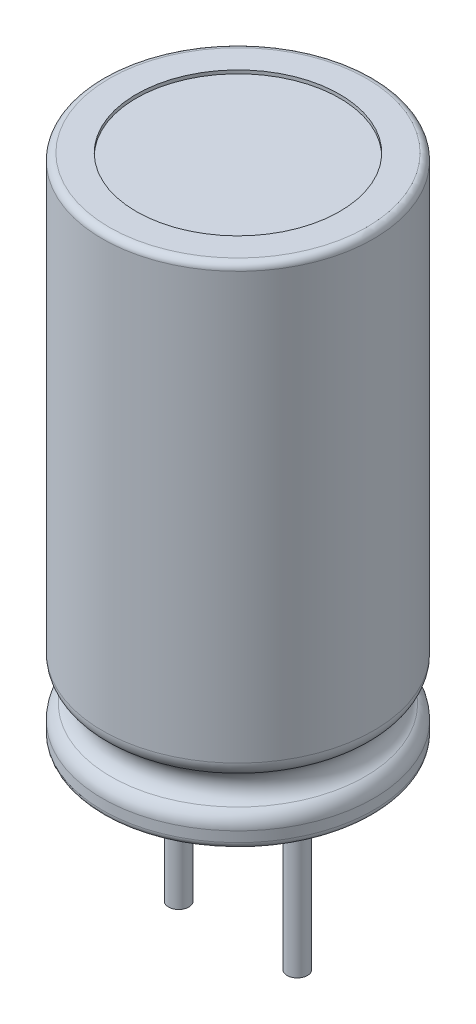
ISO-10303-21;
HEADER;
FILE_DESCRIPTION(('STEP AP214'),'2;1');
FILE_NAME('part.step','',(''),(''),'','','');
FILE_SCHEMA(('AUTOMOTIVE_DESIGN { 1 0 10303 214 1 1 1 1 }'));
ENDSEC;
DATA;
#1=APPLICATION_CONTEXT('core data for automotive mechanical design processes');
#2=APPLICATION_PROTOCOL_DEFINITION('international standard','automotive_design',2000,#1);
#3=PRODUCT_CONTEXT('',#1,'mechanical');
#4=PRODUCT('Part','Part','',(#3));
#5=PRODUCT_RELATED_PRODUCT_CATEGORY('part','',(#4));
#6=PRODUCT_DEFINITION_FORMATION('','',#4);
#7=PRODUCT_DEFINITION_CONTEXT('part definition',#1,'design');
#8=PRODUCT_DEFINITION('design','',#6,#7);
#9=PRODUCT_DEFINITION_SHAPE('','',#8);
#10=(LENGTH_UNIT() NAMED_UNIT(*) SI_UNIT(.MILLI.,.METRE.));
#11=(NAMED_UNIT(*) PLANE_ANGLE_UNIT() SI_UNIT($,.RADIAN.));
#12=(NAMED_UNIT(*) SI_UNIT($,.STERADIAN.) SOLID_ANGLE_UNIT());
#13=UNCERTAINTY_MEASURE_WITH_UNIT(LENGTH_MEASURE(1.E-05),#10,'distance_accuracy_value','');
#14=(GEOMETRIC_REPRESENTATION_CONTEXT(3) GLOBAL_UNCERTAINTY_ASSIGNED_CONTEXT((#13)) GLOBAL_UNIT_ASSIGNED_CONTEXT((#10,
#11,#12)) REPRESENTATION_CONTEXT('',''));
#15=CARTESIAN_POINT('',(0.,0.,0.));
#16=DIRECTION('',(0.,0.,1.));
#17=DIRECTION('',(1.,0.,0.));
#18=AXIS2_PLACEMENT_3D('',#15,#16,#17);
#19=CARTESIAN_POINT('',(1.75,-5.,0.));
#20=DIRECTION('',(0.,1.,0.));
#21=DIRECTION('',(0.,0.,1.));
#22=AXIS2_PLACEMENT_3D('',#19,#20,#21);
#23=CYLINDRICAL_SURFACE('',#22,0.3);
#24=CARTESIAN_POINT('',(1.75,-5.,0.));
#25=DIRECTION('',(0.,-1.,0.));
#26=DIRECTION('',(0.,0.,-1.));
#27=AXIS2_PLACEMENT_3D('',#24,#25,#26);
#28=CIRCLE('',#27,0.3);
#29=CARTESIAN_POINT('',(1.75,-5.,-0.3));
#30=VERTEX_POINT('',#29);
#31=EDGE_CURVE('E11',#30,#30,#28,.T.);
#32=ORIENTED_EDGE('',*,*,#31,.F.);
#33=EDGE_LOOP('',(#32));
#34=FACE_BOUND('',#33,.T.);
#35=CARTESIAN_POINT('',(1.75,5.,0.));
#36=DIRECTION('',(0.,-1.,0.));
#37=DIRECTION('',(0.,0.,-1.));
#38=AXIS2_PLACEMENT_3D('',#35,#36,#37);
#39=CIRCLE('',#38,0.3);
#40=CARTESIAN_POINT('',(1.75,5.,-0.3));
#41=VERTEX_POINT('',#40);
#42=EDGE_CURVE('E43',#41,#41,#39,.T.);
#43=ORIENTED_EDGE('',*,*,#42,.T.);
#44=EDGE_LOOP('',(#43));
#45=FACE_BOUND('',#44,.T.);
#46=ADVANCED_FACE('F40',(#34,#45),#23,.T.);
#47=CARTESIAN_POINT('',(1.75,-5.,0.));
#48=DIRECTION('',(0.,-1.,0.));
#49=DIRECTION('',(0.,0.,-1.));
#50=AXIS2_PLACEMENT_3D('',#47,#48,#49);
#51=PLANE('',#50);
#52=ORIENTED_EDGE('',*,*,#31,.T.);
#53=EDGE_LOOP('',(#52));
#54=FACE_BOUND('',#53,.T.);
#55=ADVANCED_FACE('F55',(#54),#51,.T.);
#56=CARTESIAN_POINT('',(1.75,5.,0.));
#57=DIRECTION('',(0.,-1.,0.));
#58=DIRECTION('',(0.,0.,-1.));
#59=AXIS2_PLACEMENT_3D('',#56,#57,#58);
#60=PLANE('',#59);
#61=ORIENTED_EDGE('',*,*,#42,.F.);
#62=EDGE_LOOP('',(#61));
#63=FACE_BOUND('',#62,.T.);
#64=ADVANCED_FACE('F53',(#63),#60,.F.);
#65=CLOSED_SHELL('',(#46,#55,#64));
#66=MANIFOLD_SOLID_BREP('B2',#65);
#67=CARTESIAN_POINT('',(-1.75,-5.,0.));
#68=DIRECTION('',(0.,1.,0.));
#69=DIRECTION('',(0.,0.,1.));
#70=AXIS2_PLACEMENT_3D('',#67,#68,#69);
#71=CYLINDRICAL_SURFACE('',#70,0.3);
#72=CARTESIAN_POINT('',(-1.75,-5.,0.));
#73=DIRECTION('',(0.,-1.,0.));
#74=DIRECTION('',(0.,0.,-1.));
#75=AXIS2_PLACEMENT_3D('',#72,#73,#74);
#76=CIRCLE('',#75,0.3);
#77=CARTESIAN_POINT('',(-1.75,-5.,-0.300000000000001));
#78=VERTEX_POINT('',#77);
#79=EDGE_CURVE('E39',#78,#78,#76,.T.);
#80=ORIENTED_EDGE('',*,*,#79,.F.);
#81=EDGE_LOOP('',(#80));
#82=FACE_BOUND('',#81,.T.);
#83=CARTESIAN_POINT('',(-1.75,5.,0.));
#84=DIRECTION('',(0.,-1.,0.));
#85=DIRECTION('',(0.,0.,-1.));
#86=AXIS2_PLACEMENT_3D('',#83,#84,#85);
#87=CIRCLE('',#86,0.3);
#88=CARTESIAN_POINT('',(-1.75,5.,-0.300000000000001));
#89=VERTEX_POINT('',#88);
#90=EDGE_CURVE('E91',#89,#89,#87,.T.);
#91=ORIENTED_EDGE('',*,*,#90,.T.);
#92=EDGE_LOOP('',(#91));
#93=FACE_BOUND('',#92,.T.);
#94=ADVANCED_FACE('F88',(#82,#93),#71,.T.);
#95=CARTESIAN_POINT('',(-1.75,-5.,0.));
#96=DIRECTION('',(0.,-1.,0.));
#97=DIRECTION('',(0.,0.,-1.));
#98=AXIS2_PLACEMENT_3D('',#95,#96,#97);
#99=PLANE('',#98);
#100=ORIENTED_EDGE('',*,*,#79,.T.);
#101=EDGE_LOOP('',(#100));
#102=FACE_BOUND('',#101,.T.);
#103=ADVANCED_FACE('F103',(#102),#99,.T.);
#104=CARTESIAN_POINT('',(-1.75,5.,0.));
#105=DIRECTION('',(0.,-1.,0.));
#106=DIRECTION('',(0.,0.,-1.));
#107=AXIS2_PLACEMENT_3D('',#104,#105,#106);
#108=PLANE('',#107);
#109=ORIENTED_EDGE('',*,*,#90,.F.);
#110=EDGE_LOOP('',(#109));
#111=FACE_BOUND('',#110,.T.);
#112=ADVANCED_FACE('F101',(#111),#108,.F.);
#113=CLOSED_SHELL('',(#94,#103,#112));
#114=MANIFOLD_SOLID_BREP('B6',#113);
#115=CARTESIAN_POINT('',(-4.,0.,0.));
#116=DIRECTION('',(0.,1.,0.));
#117=DIRECTION('',(0.,0.,1.));
#118=AXIS2_PLACEMENT_3D('',#115,#116,#117);
#119=PLANE('',#118);
#120=CARTESIAN_POINT('',(0.,0.,0.));
#121=DIRECTION('',(0.,-1.,0.));
#122=DIRECTION('',(0.,0.,-1.));
#123=AXIS2_PLACEMENT_3D('',#120,#121,#122);
#124=CIRCLE('',#123,3.);
#125=CARTESIAN_POINT('',(0.,0.,-3.));
#126=VERTEX_POINT('',#125);
#127=EDGE_CURVE('E168',#126,#126,#124,.T.);
#128=ORIENTED_EDGE('',*,*,#127,.F.);
#129=EDGE_LOOP('',(#128));
#130=FACE_BOUND('',#129,.T.);
#131=CARTESIAN_POINT('',(0.,0.,0.));
#132=DIRECTION('',(0.,1.,0.));
#133=DIRECTION('',(0.,0.,1.));
#134=AXIS2_PLACEMENT_3D('',#131,#132,#133);
#135=CIRCLE('',#134,3.8);
#136=CARTESIAN_POINT('',(0.,0.,3.8));
#137=VERTEX_POINT('',#136);
#138=EDGE_CURVE('E144',#137,#137,#135,.F.);
#139=ORIENTED_EDGE('',*,*,#138,.T.);
#140=EDGE_LOOP('',(#139));
#141=FACE_BOUND('',#140,.T.);
#142=ADVANCED_FACE('F129',(#130,#141),#119,.F.);
#143=CARTESIAN_POINT('',(0.,15.,0.));
#144=DIRECTION('',(0.,-1.,0.));
#145=DIRECTION('',(0.,0.,-1.));
#146=AXIS2_PLACEMENT_3D('',#143,#144,#145);
#147=PLANE('',#146);
#148=CARTESIAN_POINT('',(0.,15.,0.));
#149=DIRECTION('',(0.,1.,0.));
#150=DIRECTION('',(0.,0.,1.));
#151=AXIS2_PLACEMENT_3D('',#148,#149,#150);
#152=CIRCLE('',#151,3.);
#153=CARTESIAN_POINT('',(0.,15.,3.));
#154=VERTEX_POINT('',#153);
#155=EDGE_CURVE('E162',#154,#154,#152,.T.);
#156=ORIENTED_EDGE('',*,*,#155,.F.);
#157=EDGE_LOOP('',(#156));
#158=FACE_BOUND('',#157,.T.);
#159=CARTESIAN_POINT('',(0.,15.,0.));
#160=DIRECTION('',(0.,-1.,0.));
#161=DIRECTION('',(0.,0.,-1.));
#162=AXIS2_PLACEMENT_3D('',#159,#160,#161);
#163=CIRCLE('',#162,3.8);
#164=CARTESIAN_POINT('',(0.,15.,-3.8));
#165=VERTEX_POINT('',#164);
#166=EDGE_CURVE('E87',#165,#165,#163,.F.);
#167=ORIENTED_EDGE('',*,*,#166,.T.);
#168=EDGE_LOOP('',(#167));
#169=FACE_BOUND('',#168,.T.);
#170=ADVANCED_FACE('F185',(#158,#169),#147,.F.);
#171=CARTESIAN_POINT('',(0.,0.,0.));
#172=DIRECTION('',(0.,-1.,0.));
#173=DIRECTION('',(0.,0.,-1.));
#174=AXIS2_PLACEMENT_3D('',#171,#172,#173);
#175=CYLINDRICAL_SURFACE('',#174,4.);
#176=CARTESIAN_POINT('',(0.,14.8,0.));
#177=DIRECTION('',(0.,-1.,0.));
#178=DIRECTION('',(0.,0.,-1.));
#179=AXIS2_PLACEMENT_3D('',#176,#177,#178);
#180=CIRCLE('',#179,4.);
#181=CARTESIAN_POINT('',(0.,14.8,-4.));
#182=VERTEX_POINT('',#181);
#183=EDGE_CURVE('E136',#182,#182,#180,.T.);
#184=ORIENTED_EDGE('',*,*,#183,.T.);
#185=EDGE_LOOP('',(#184));
#186=FACE_BOUND('',#185,.T.);
#187=CARTESIAN_POINT('',(0.,2.23205080756888,0.));
#188=DIRECTION('',(0.,-1.,0.));
#189=DIRECTION('',(0.,0.,-1.));
#190=AXIS2_PLACEMENT_3D('',#187,#188,#189);
#191=CIRCLE('',#190,4.);
#192=CARTESIAN_POINT('',(0.,2.23205080756888,-4.));
#193=VERTEX_POINT('',#192);
#194=EDGE_CURVE('E149',#193,#193,#191,.T.);
#195=ORIENTED_EDGE('',*,*,#194,.F.);
#196=EDGE_LOOP('',(#195));
#197=FACE_BOUND('',#196,.T.);
#198=ADVANCED_FACE('F206',(#186,#197),#175,.T.);
#199=CARTESIAN_POINT('',(0.,2.23205080756888,0.));
#200=DIRECTION('',(0.,-1.,0.));
#201=DIRECTION('',(0.,0.,-1.));
#202=AXIS2_PLACEMENT_3D('',#199,#200,#201);
#203=TOROIDAL_SURFACE('',#202,3.5,0.5);
#204=CARTESIAN_POINT('',(0.,1.79903810567666,0.));
#205=DIRECTION('',(0.,-1.,0.));
#206=DIRECTION('',(0.,0.,-1.));
#207=AXIS2_PLACEMENT_3D('',#204,#205,#206);
#208=CIRCLE('',#207,3.75);
#209=CARTESIAN_POINT('',(0.,1.79903810567666,-3.75));
#210=VERTEX_POINT('',#209);
#211=EDGE_CURVE('E152',#210,#210,#208,.T.);
#212=ORIENTED_EDGE('',*,*,#211,.F.);
#213=EDGE_LOOP('',(#212));
#214=FACE_BOUND('',#213,.T.);
#215=ORIENTED_EDGE('',*,*,#194,.T.);
#216=EDGE_LOOP('',(#215));
#217=FACE_BOUND('',#216,.T.);
#218=ADVANCED_FACE('F210',(#214,#217),#203,.T.);
#219=CARTESIAN_POINT('',(0.,1.36602540378444,0.));
#220=DIRECTION('',(0.,-1.,0.));
#221=DIRECTION('',(0.,0.,-1.));
#222=AXIS2_PLACEMENT_3D('',#219,#220,#221);
#223=TOROIDAL_SURFACE('',#222,4.,0.5);
#224=CARTESIAN_POINT('',(0.,0.93301270189222,0.));
#225=DIRECTION('',(0.,-1.,0.));
#226=DIRECTION('',(0.,0.,-1.));
#227=AXIS2_PLACEMENT_3D('',#224,#225,#226);
#228=CIRCLE('',#227,3.75);
#229=CARTESIAN_POINT('',(0.,0.93301270189222,-3.75));
#230=VERTEX_POINT('',#229);
#231=EDGE_CURVE('E155',#230,#230,#228,.T.);
#232=ORIENTED_EDGE('',*,*,#231,.F.);
#233=EDGE_LOOP('',(#232));
#234=FACE_BOUND('',#233,.T.);
#235=ORIENTED_EDGE('',*,*,#211,.T.);
#236=EDGE_LOOP('',(#235));
#237=FACE_BOUND('',#236,.T.);
#238=ADVANCED_FACE('F213',(#234,#237),#223,.F.);
#239=CARTESIAN_POINT('',(0.,0.5,0.));
#240=DIRECTION('',(0.,-1.,0.));
#241=DIRECTION('',(0.,0.,-1.));
#242=AXIS2_PLACEMENT_3D('',#239,#240,#241);
#243=TOROIDAL_SURFACE('',#242,3.5,0.5);
#244=CARTESIAN_POINT('',(0.,0.5,0.));
#245=DIRECTION('',(0.,-1.,0.));
#246=DIRECTION('',(0.,0.,-1.));
#247=AXIS2_PLACEMENT_3D('',#244,#245,#246);
#248=CIRCLE('',#247,4.);
#249=CARTESIAN_POINT('',(0.,0.5,-4.));
#250=VERTEX_POINT('',#249);
#251=EDGE_CURVE('E158',#250,#250,#248,.T.);
#252=ORIENTED_EDGE('',*,*,#251,.F.);
#253=EDGE_LOOP('',(#252));
#254=FACE_BOUND('',#253,.T.);
#255=ORIENTED_EDGE('',*,*,#231,.T.);
#256=EDGE_LOOP('',(#255));
#257=FACE_BOUND('',#256,.T.);
#258=ADVANCED_FACE('F199',(#254,#257),#243,.T.);
#259=CARTESIAN_POINT('',(0.,0.,0.));
#260=DIRECTION('',(0.,-1.,0.));
#261=DIRECTION('',(0.,0.,-1.));
#262=AXIS2_PLACEMENT_3D('',#259,#260,#261);
#263=CYLINDRICAL_SURFACE('',#262,4.);
#264=CARTESIAN_POINT('',(0.,0.2,0.));
#265=DIRECTION('',(0.,1.,0.));
#266=DIRECTION('',(0.,0.,1.));
#267=AXIS2_PLACEMENT_3D('',#264,#265,#266);
#268=CIRCLE('',#267,4.);
#269=CARTESIAN_POINT('',(0.,0.2,4.));
#270=VERTEX_POINT('',#269);
#271=EDGE_CURVE('E140',#270,#270,#268,.T.);
#272=ORIENTED_EDGE('',*,*,#271,.T.);
#273=EDGE_LOOP('',(#272));
#274=FACE_BOUND('',#273,.T.);
#275=ORIENTED_EDGE('',*,*,#251,.T.);
#276=EDGE_LOOP('',(#275));
#277=FACE_BOUND('',#276,.T.);
#278=ADVANCED_FACE('F191',(#274,#277),#263,.T.);
#279=CARTESIAN_POINT('',(0.,0.2,0.));
#280=DIRECTION('',(0.,1.,0.));
#281=DIRECTION('',(0.,0.,1.));
#282=AXIS2_PLACEMENT_3D('',#279,#280,#281);
#283=TOROIDAL_SURFACE('',#282,3.8,0.2);
#284=ORIENTED_EDGE('',*,*,#271,.F.);
#285=EDGE_LOOP('',(#284));
#286=FACE_BOUND('',#285,.T.);
#287=ORIENTED_EDGE('',*,*,#138,.F.);
#288=EDGE_LOOP('',(#287));
#289=FACE_BOUND('',#288,.T.);
#290=ADVANCED_FACE('F189',(#286,#289),#283,.T.);
#291=CARTESIAN_POINT('',(0.,14.8,0.));
#292=DIRECTION('',(0.,-1.,0.));
#293=DIRECTION('',(0.,0.,-1.));
#294=AXIS2_PLACEMENT_3D('',#291,#292,#293);
#295=TOROIDAL_SURFACE('',#294,3.8,0.2);
#296=ORIENTED_EDGE('',*,*,#166,.F.);
#297=EDGE_LOOP('',(#296));
#298=FACE_BOUND('',#297,.T.);
#299=ORIENTED_EDGE('',*,*,#183,.F.);
#300=EDGE_LOOP('',(#299));
#301=FACE_BOUND('',#300,.T.);
#302=ADVANCED_FACE('F131',(#298,#301),#295,.T.);
#303=CARTESIAN_POINT('',(0.,14.9,0.));
#304=DIRECTION('',(0.,1.,0.));
#305=DIRECTION('',(0.,0.,1.));
#306=AXIS2_PLACEMENT_3D('',#303,#304,#305);
#307=CYLINDRICAL_SURFACE('',#306,3.);
#308=CARTESIAN_POINT('',(0.,14.9,0.));
#309=DIRECTION('',(0.,1.,0.));
#310=DIRECTION('',(0.,0.,1.));
#311=AXIS2_PLACEMENT_3D('',#308,#309,#310);
#312=CIRCLE('',#311,3.);
#313=CARTESIAN_POINT('',(0.,14.9,3.));
#314=VERTEX_POINT('',#313);
#315=EDGE_CURVE('E161',#314,#314,#312,.T.);
#316=ORIENTED_EDGE('',*,*,#315,.F.);
#317=EDGE_LOOP('',(#316));
#318=FACE_BOUND('',#317,.T.);
#319=ORIENTED_EDGE('',*,*,#155,.T.);
#320=EDGE_LOOP('',(#319));
#321=FACE_BOUND('',#320,.T.);
#322=ADVANCED_FACE('F197',(#318,#321),#307,.F.);
#323=CARTESIAN_POINT('',(0.,14.9,0.));
#324=DIRECTION('',(0.,1.,0.));
#325=DIRECTION('',(0.,0.,1.));
#326=AXIS2_PLACEMENT_3D('',#323,#324,#325);
#327=PLANE('',#326);
#328=ORIENTED_EDGE('',*,*,#315,.T.);
#329=EDGE_LOOP('',(#328));
#330=FACE_BOUND('',#329,.T.);
#331=ADVANCED_FACE('F179',(#330),#327,.T.);
#332=CARTESIAN_POINT('',(0.,0.1,0.));
#333=DIRECTION('',(0.,-1.,0.));
#334=DIRECTION('',(0.,0.,-1.));
#335=AXIS2_PLACEMENT_3D('',#332,#333,#334);
#336=CYLINDRICAL_SURFACE('',#335,3.);
#337=CARTESIAN_POINT('',(0.,0.1,0.));
#338=DIRECTION('',(0.,-1.,0.));
#339=DIRECTION('',(0.,0.,-1.));
#340=AXIS2_PLACEMENT_3D('',#337,#338,#339);
#341=CIRCLE('',#340,3.);
#342=CARTESIAN_POINT('',(0.,0.1,-3.));
#343=VERTEX_POINT('',#342);
#344=EDGE_CURVE('E165',#343,#343,#341,.T.);
#345=ORIENTED_EDGE('',*,*,#344,.F.);
#346=EDGE_LOOP('',(#345));
#347=FACE_BOUND('',#346,.T.);
#348=ORIENTED_EDGE('',*,*,#127,.T.);
#349=EDGE_LOOP('',(#348));
#350=FACE_BOUND('',#349,.T.);
#351=ADVANCED_FACE('F176',(#347,#350),#336,.F.);
#352=CARTESIAN_POINT('',(0.,0.1,0.));
#353=DIRECTION('',(0.,-1.,0.));
#354=DIRECTION('',(0.,0.,-1.));
#355=AXIS2_PLACEMENT_3D('',#352,#353,#354);
#356=PLANE('',#355);
#357=ORIENTED_EDGE('',*,*,#344,.T.);
#358=EDGE_LOOP('',(#357));
#359=FACE_BOUND('',#358,.T.);
#360=ADVANCED_FACE('F174',(#359),#356,.T.);
#361=CLOSED_SHELL('',(#142,#170,#198,#218,#238,#258,#278,#290,#302,#322,#331,#351,#360));
#362=MANIFOLD_SOLID_BREP('B34',#361);
#363=ADVANCED_BREP_SHAPE_REPRESENTATION('',(#18,#66,#114,#362),#14);
#364=SHAPE_DEFINITION_REPRESENTATION(#9,#363);
ENDSEC;
END-ISO-10303-21;
